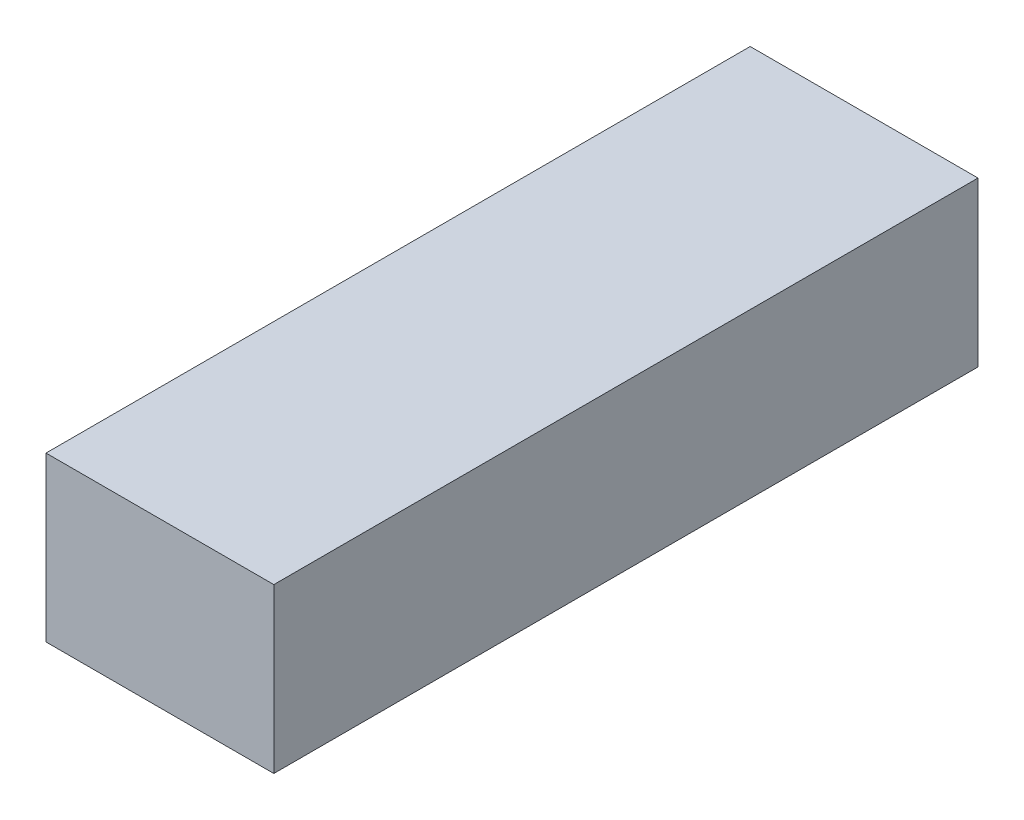
ISO-10303-21;
HEADER;
FILE_DESCRIPTION(('STEP AP214'),'2;1');
FILE_NAME('part.step','',(''),(''),'','','');
FILE_SCHEMA(('AUTOMOTIVE_DESIGN { 1 0 10303 214 1 1 1 1 }'));
ENDSEC;
DATA;
#1=APPLICATION_CONTEXT('core data for automotive mechanical design processes');
#2=APPLICATION_PROTOCOL_DEFINITION('international standard','automotive_design',2000,#1);
#3=PRODUCT_CONTEXT('',#1,'mechanical');
#4=PRODUCT('Part','Part','',(#3));
#5=PRODUCT_RELATED_PRODUCT_CATEGORY('part','',(#4));
#6=PRODUCT_DEFINITION_FORMATION('','',#4);
#7=PRODUCT_DEFINITION_CONTEXT('part definition',#1,'design');
#8=PRODUCT_DEFINITION('design','',#6,#7);
#9=PRODUCT_DEFINITION_SHAPE('','',#8);
#10=(LENGTH_UNIT() NAMED_UNIT(*) SI_UNIT(.MILLI.,.METRE.));
#11=(NAMED_UNIT(*) PLANE_ANGLE_UNIT() SI_UNIT($,.RADIAN.));
#12=(NAMED_UNIT(*) SI_UNIT($,.STERADIAN.) SOLID_ANGLE_UNIT());
#13=UNCERTAINTY_MEASURE_WITH_UNIT(LENGTH_MEASURE(1.E-05),#10,'distance_accuracy_value','');
#14=(GEOMETRIC_REPRESENTATION_CONTEXT(3) GLOBAL_UNCERTAINTY_ASSIGNED_CONTEXT((#13)) GLOBAL_UNIT_ASSIGNED_CONTEXT((#10,
#11,#12)) REPRESENTATION_CONTEXT('',''));
#15=CARTESIAN_POINT('',(0.,0.,0.));
#16=DIRECTION('',(0.,0.,1.));
#17=DIRECTION('',(1.,0.,0.));
#18=AXIS2_PLACEMENT_3D('',#15,#16,#17);
#19=CARTESIAN_POINT('',(22.,-15.8,136.));
#20=DIRECTION('',(-1.,0.,0.));
#21=DIRECTION('',(0.,0.,1.));
#22=AXIS2_PLACEMENT_3D('',#19,#20,#21);
#23=PLANE('',#22);
#24=DIRECTION('',(0.,1.,0.));
#25=VECTOR('',#24,1.);
#26=CARTESIAN_POINT('',(22.,-15.8,0.));
#27=LINE('',#26,#25);
#28=CARTESIAN_POINT('',(22.,-15.8,0.));
#29=VERTEX_POINT('',#28);
#30=CARTESIAN_POINT('',(22.,15.8,0.));
#31=VERTEX_POINT('',#30);
#32=EDGE_CURVE('E95',#29,#31,#27,.T.);
#33=ORIENTED_EDGE('',*,*,#32,.T.);
#34=DIRECTION('',(0.,0.,-1.));
#35=VECTOR('',#34,1.);
#36=CARTESIAN_POINT('',(22.,15.8,136.));
#37=LINE('',#36,#35);
#38=CARTESIAN_POINT('',(22.,15.8,136.));
#39=VERTEX_POINT('',#38);
#40=EDGE_CURVE('E11',#39,#31,#37,.T.);
#41=ORIENTED_EDGE('',*,*,#40,.F.);
#42=DIRECTION('',(0.,1.,0.));
#43=VECTOR('',#42,1.);
#44=CARTESIAN_POINT('',(22.,-15.8,136.));
#45=LINE('',#44,#43);
#46=CARTESIAN_POINT('',(22.,-15.8,136.));
#47=VERTEX_POINT('',#46);
#48=EDGE_CURVE('E83',#47,#39,#45,.T.);
#49=ORIENTED_EDGE('',*,*,#48,.F.);
#50=DIRECTION('',(0.,0.,-1.));
#51=VECTOR('',#50,1.);
#52=CARTESIAN_POINT('',(22.,-15.8,136.));
#53=LINE('',#52,#51);
#54=EDGE_CURVE('E91',#47,#29,#53,.T.);
#55=ORIENTED_EDGE('',*,*,#54,.T.);
#56=EDGE_LOOP('',(#33,#41,#49,#55));
#57=FACE_BOUND('',#56,.T.);
#58=ADVANCED_FACE('F32',(#57),#23,.F.);
#59=CARTESIAN_POINT('',(-22.,15.8,136.));
#60=DIRECTION('',(0.,-1.,0.));
#61=DIRECTION('',(0.,0.,-1.));
#62=AXIS2_PLACEMENT_3D('',#59,#60,#61);
#63=PLANE('',#62);
#64=DIRECTION('',(-1.,0.,0.));
#65=VECTOR('',#64,1.);
#66=CARTESIAN_POINT('',(-22.,15.8,0.));
#67=LINE('',#66,#65);
#68=CARTESIAN_POINT('',(-22.,15.8,0.));
#69=VERTEX_POINT('',#68);
#70=EDGE_CURVE('E87',#31,#69,#67,.T.);
#71=ORIENTED_EDGE('',*,*,#70,.T.);
#72=DIRECTION('',(0.,0.,-1.));
#73=VECTOR('',#72,1.);
#74=CARTESIAN_POINT('',(-22.,15.8,136.));
#75=LINE('',#74,#73);
#76=CARTESIAN_POINT('',(-22.,15.8,136.));
#77=VERTEX_POINT('',#76);
#78=EDGE_CURVE('E40',#77,#69,#75,.T.);
#79=ORIENTED_EDGE('',*,*,#78,.F.);
#80=DIRECTION('',(-1.,0.,0.));
#81=VECTOR('',#80,1.);
#82=CARTESIAN_POINT('',(-22.,15.8,136.));
#83=LINE('',#82,#81);
#84=EDGE_CURVE('E78',#39,#77,#83,.T.);
#85=ORIENTED_EDGE('',*,*,#84,.F.);
#86=ORIENTED_EDGE('',*,*,#40,.T.);
#87=EDGE_LOOP('',(#71,#79,#85,#86));
#88=FACE_BOUND('',#87,.T.);
#89=ADVANCED_FACE('F86',(#88),#63,.F.);
#90=CARTESIAN_POINT('',(-22.,-15.8,136.));
#91=DIRECTION('',(1.,0.,0.));
#92=DIRECTION('',(0.,0.,-1.));
#93=AXIS2_PLACEMENT_3D('',#90,#91,#92);
#94=PLANE('',#93);
#95=DIRECTION('',(0.,-1.,0.));
#96=VECTOR('',#95,1.);
#97=CARTESIAN_POINT('',(-22.,-15.8,0.));
#98=LINE('',#97,#96);
#99=CARTESIAN_POINT('',(-22.,-15.8,0.));
#100=VERTEX_POINT('',#99);
#101=EDGE_CURVE('E65',#69,#100,#98,.T.);
#102=ORIENTED_EDGE('',*,*,#101,.T.);
#103=DIRECTION('',(0.,0.,-1.));
#104=VECTOR('',#103,1.);
#105=CARTESIAN_POINT('',(-22.,-15.8,136.));
#106=LINE('',#105,#104);
#107=CARTESIAN_POINT('',(-22.,-15.8,136.));
#108=VERTEX_POINT('',#107);
#109=EDGE_CURVE('E88',#108,#100,#106,.T.);
#110=ORIENTED_EDGE('',*,*,#109,.F.);
#111=DIRECTION('',(0.,-1.,0.));
#112=VECTOR('',#111,1.);
#113=CARTESIAN_POINT('',(-22.,-15.8,136.));
#114=LINE('',#113,#112);
#115=EDGE_CURVE('E81',#77,#108,#114,.T.);
#116=ORIENTED_EDGE('',*,*,#115,.F.);
#117=ORIENTED_EDGE('',*,*,#78,.T.);
#118=EDGE_LOOP('',(#102,#110,#116,#117));
#119=FACE_BOUND('',#118,.T.);
#120=ADVANCED_FACE('F89',(#119),#94,.F.);
#121=CARTESIAN_POINT('',(-22.,-15.8,136.));
#122=DIRECTION('',(0.,1.,0.));
#123=DIRECTION('',(0.,0.,1.));
#124=AXIS2_PLACEMENT_3D('',#121,#122,#123);
#125=PLANE('',#124);
#126=DIRECTION('',(1.,0.,0.));
#127=VECTOR('',#126,1.);
#128=CARTESIAN_POINT('',(-22.,-15.8,0.));
#129=LINE('',#128,#127);
#130=EDGE_CURVE('E71',#100,#29,#129,.T.);
#131=ORIENTED_EDGE('',*,*,#130,.T.);
#132=ORIENTED_EDGE('',*,*,#54,.F.);
#133=DIRECTION('',(1.,0.,0.));
#134=VECTOR('',#133,1.);
#135=CARTESIAN_POINT('',(-22.,-15.8,136.));
#136=LINE('',#135,#134);
#137=EDGE_CURVE('E48',#108,#47,#136,.T.);
#138=ORIENTED_EDGE('',*,*,#137,.F.);
#139=ORIENTED_EDGE('',*,*,#109,.T.);
#140=EDGE_LOOP('',(#131,#132,#138,#139));
#141=FACE_BOUND('',#140,.T.);
#142=ADVANCED_FACE('F102',(#141),#125,.F.);
#143=CARTESIAN_POINT('',(0.,0.,136.));
#144=DIRECTION('',(0.,0.,-1.));
#145=DIRECTION('',(-1.,0.,0.));
#146=AXIS2_PLACEMENT_3D('',#143,#144,#145);
#147=PLANE('',#146);
#148=ORIENTED_EDGE('',*,*,#48,.T.);
#149=ORIENTED_EDGE('',*,*,#84,.T.);
#150=ORIENTED_EDGE('',*,*,#115,.T.);
#151=ORIENTED_EDGE('',*,*,#137,.T.);
#152=EDGE_LOOP('',(#148,#149,#150,#151));
#153=FACE_BOUND('',#152,.T.);
#154=ADVANCED_FACE('F79',(#153),#147,.F.);
#155=CARTESIAN_POINT('',(0.,0.,0.));
#156=DIRECTION('',(0.,0.,-1.));
#157=DIRECTION('',(-1.,0.,0.));
#158=AXIS2_PLACEMENT_3D('',#155,#156,#157);
#159=PLANE('',#158);
#160=ORIENTED_EDGE('',*,*,#32,.F.);
#161=ORIENTED_EDGE('',*,*,#130,.F.);
#162=ORIENTED_EDGE('',*,*,#101,.F.);
#163=ORIENTED_EDGE('',*,*,#70,.F.);
#164=EDGE_LOOP('',(#160,#161,#162,#163));
#165=FACE_BOUND('',#164,.T.);
#166=ADVANCED_FACE('F105',(#165),#159,.T.);
#167=CLOSED_SHELL('',(#58,#89,#120,#142,#154,#166));
#168=MANIFOLD_SOLID_BREP('B2',#167);
#169=ADVANCED_BREP_SHAPE_REPRESENTATION('',(#18,#168),#14);
#170=SHAPE_DEFINITION_REPRESENTATION(#9,#169);
ENDSEC;
END-ISO-10303-21;
